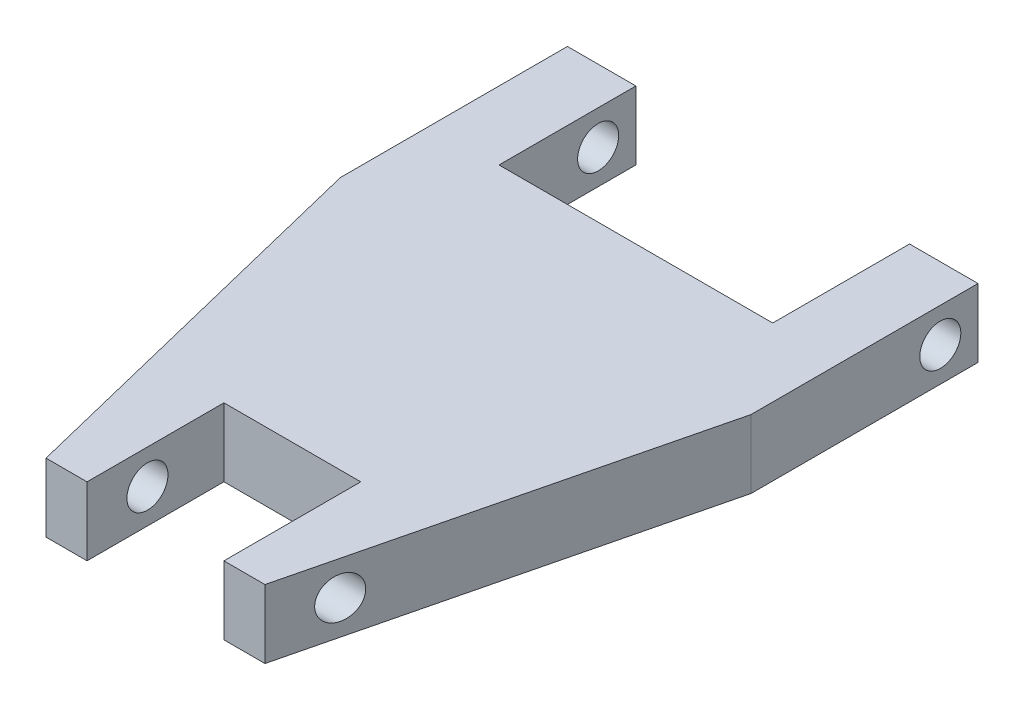
ISO-10303-21;
HEADER;
FILE_DESCRIPTION(('STEP AP214'),'2;1');
FILE_NAME('part.step','',(''),(''),'','','');
FILE_SCHEMA(('AUTOMOTIVE_DESIGN { 1 0 10303 214 1 1 1 1 }'));
ENDSEC;
DATA;
#1=APPLICATION_CONTEXT('core data for automotive mechanical design processes');
#2=APPLICATION_PROTOCOL_DEFINITION('international standard','automotive_design',2000,#1);
#3=PRODUCT_CONTEXT('',#1,'mechanical');
#4=PRODUCT('Part','Part','',(#3));
#5=PRODUCT_RELATED_PRODUCT_CATEGORY('part','',(#4));
#6=PRODUCT_DEFINITION_FORMATION('','',#4);
#7=PRODUCT_DEFINITION_CONTEXT('part definition',#1,'design');
#8=PRODUCT_DEFINITION('design','',#6,#7);
#9=PRODUCT_DEFINITION_SHAPE('','',#8);
#10=(LENGTH_UNIT() NAMED_UNIT(*) SI_UNIT(.MILLI.,.METRE.));
#11=(NAMED_UNIT(*) PLANE_ANGLE_UNIT() SI_UNIT($,.RADIAN.));
#12=(NAMED_UNIT(*) SI_UNIT($,.STERADIAN.) SOLID_ANGLE_UNIT());
#13=UNCERTAINTY_MEASURE_WITH_UNIT(LENGTH_MEASURE(1.E-05),#10,'distance_accuracy_value','');
#14=(GEOMETRIC_REPRESENTATION_CONTEXT(3) GLOBAL_UNCERTAINTY_ASSIGNED_CONTEXT((#13)) GLOBAL_UNIT_ASSIGNED_CONTEXT((#10,
#11,#12)) REPRESENTATION_CONTEXT('',''));
#15=CARTESIAN_POINT('',(0.,0.,0.));
#16=DIRECTION('',(0.,0.,1.));
#17=DIRECTION('',(1.,0.,0.));
#18=AXIS2_PLACEMENT_3D('',#15,#16,#17);
#19=CARTESIAN_POINT('',(0.,3.175,15.9557985351339));
#20=DIRECTION('',(0.,0.,-1.));
#21=DIRECTION('',(-1.,0.,0.));
#22=AXIS2_PLACEMENT_3D('',#19,#20,#21);
#23=PLANE('',#22);
#24=DIRECTION('',(1.,0.,0.));
#25=VECTOR('',#24,1.);
#26=CARTESIAN_POINT('',(0.,-3.175,15.9557985351339));
#27=LINE('',#26,#25);
#28=CARTESIAN_POINT('',(-6.35,-3.175,15.9557985351339));
#29=VERTEX_POINT('',#28);
#30=CARTESIAN_POINT('',(6.35000000000001,-3.175,15.9557985351339));
#31=VERTEX_POINT('',#30);
#32=EDGE_CURVE('E172',#29,#31,#27,.T.);
#33=ORIENTED_EDGE('',*,*,#32,.T.);
#34=DIRECTION('',(0.,-1.,0.));
#35=VECTOR('',#34,1.);
#36=CARTESIAN_POINT('',(6.35000000000001,3.175,15.9557985351339));
#37=LINE('',#36,#35);
#38=CARTESIAN_POINT('',(6.35000000000001,3.175,15.9557985351339));
#39=VERTEX_POINT('',#38);
#40=EDGE_CURVE('E11',#39,#31,#37,.T.);
#41=ORIENTED_EDGE('',*,*,#40,.F.);
#42=DIRECTION('',(1.,0.,0.));
#43=VECTOR('',#42,1.);
#44=CARTESIAN_POINT('',(0.,3.175,15.9557985351339));
#45=LINE('',#44,#43);
#46=CARTESIAN_POINT('',(-6.35,3.175,15.9557985351339));
#47=VERTEX_POINT('',#46);
#48=EDGE_CURVE('E115',#47,#39,#45,.T.);
#49=ORIENTED_EDGE('',*,*,#48,.F.);
#50=DIRECTION('',(0.,-1.,0.));
#51=VECTOR('',#50,1.);
#52=CARTESIAN_POINT('',(-6.35,3.175,15.9557985351339));
#53=LINE('',#52,#51);
#54=EDGE_CURVE('E168',#47,#29,#53,.T.);
#55=ORIENTED_EDGE('',*,*,#54,.T.);
#56=EDGE_LOOP('',(#33,#41,#49,#55));
#57=FACE_BOUND('',#56,.T.);
#58=ADVANCED_FACE('F40',(#57),#23,.F.);
#59=CARTESIAN_POINT('',(6.35,3.175,0.));
#60=DIRECTION('',(-1.,0.,0.));
#61=DIRECTION('',(0.,0.,1.));
#62=AXIS2_PLACEMENT_3D('',#59,#60,#61);
#63=PLANE('',#62);
#64=CARTESIAN_POINT('',(6.35000000000001,0.,23.0497661701747));
#65=DIRECTION('',(-1.,0.,0.));
#66=DIRECTION('',(0.,0.,1.));
#67=AXIS2_PLACEMENT_3D('',#64,#65,#66);
#68=CIRCLE('',#67,1.905);
#69=CARTESIAN_POINT('',(6.35000000000001,0.,24.9547661701747));
#70=VERTEX_POINT('',#69);
#71=EDGE_CURVE('E342',#70,#70,#68,.T.);
#72=ORIENTED_EDGE('',*,*,#71,.F.);
#73=EDGE_LOOP('',(#72));
#74=FACE_BOUND('',#73,.T.);
#75=DIRECTION('',(0.,0.,-1.));
#76=VECTOR('',#75,1.);
#77=CARTESIAN_POINT('',(6.35,-3.175,0.));
#78=LINE('',#77,#76);
#79=CARTESIAN_POINT('',(6.35000000000001,-3.175,28.6557985351339));
#80=VERTEX_POINT('',#79);
#81=EDGE_CURVE('E175',#80,#31,#78,.T.);
#82=ORIENTED_EDGE('',*,*,#81,.F.);
#83=DIRECTION('',(0.,-1.,0.));
#84=VECTOR('',#83,1.);
#85=CARTESIAN_POINT('',(6.35000000000001,3.175,28.6557985351339));
#86=LINE('',#85,#84);
#87=CARTESIAN_POINT('',(6.35000000000001,3.175,28.6557985351339));
#88=VERTEX_POINT('',#87);
#89=EDGE_CURVE('E49',#88,#80,#86,.T.);
#90=ORIENTED_EDGE('',*,*,#89,.F.);
#91=DIRECTION('',(0.,0.,-1.));
#92=VECTOR('',#91,1.);
#93=CARTESIAN_POINT('',(6.35,3.175,0.));
#94=LINE('',#93,#92);
#95=EDGE_CURVE('E249',#88,#39,#94,.T.);
#96=ORIENTED_EDGE('',*,*,#95,.T.);
#97=ORIENTED_EDGE('',*,*,#40,.T.);
#98=EDGE_LOOP('',(#82,#90,#96,#97));
#99=FACE_BOUND('',#98,.T.);
#100=ADVANCED_FACE('F236',(#74,#99),#63,.T.);
#101=CARTESIAN_POINT('',(0.,3.175,28.6557985351339));
#102=DIRECTION('',(0.,0.,1.));
#103=DIRECTION('',(1.,0.,0.));
#104=AXIS2_PLACEMENT_3D('',#101,#102,#103);
#105=PLANE('',#104);
#106=DIRECTION('',(-1.,0.,0.));
#107=VECTOR('',#106,1.);
#108=CARTESIAN_POINT('',(0.,-3.175,28.6557985351339));
#109=LINE('',#108,#107);
#110=CARTESIAN_POINT('',(10.16,-3.175,28.6557985351339));
#111=VERTEX_POINT('',#110);
#112=EDGE_CURVE('E179',#111,#80,#109,.T.);
#113=ORIENTED_EDGE('',*,*,#112,.F.);
#114=DIRECTION('',(0.,-1.,0.));
#115=VECTOR('',#114,1.);
#116=CARTESIAN_POINT('',(10.16,3.175,28.6557985351339));
#117=LINE('',#116,#115);
#118=CARTESIAN_POINT('',(10.16,3.175,28.6557985351339));
#119=VERTEX_POINT('',#118);
#120=EDGE_CURVE('E225',#119,#111,#117,.T.);
#121=ORIENTED_EDGE('',*,*,#120,.F.);
#122=DIRECTION('',(-1.,0.,0.));
#123=VECTOR('',#122,1.);
#124=CARTESIAN_POINT('',(0.,3.175,28.6557985351339));
#125=LINE('',#124,#123);
#126=EDGE_CURVE('E233',#119,#88,#125,.T.);
#127=ORIENTED_EDGE('',*,*,#126,.T.);
#128=ORIENTED_EDGE('',*,*,#89,.T.);
#129=EDGE_LOOP('',(#113,#121,#127,#128));
#130=FACE_BOUND('',#129,.T.);
#131=ADVANCED_FACE('F231',(#130),#105,.T.);
#132=CARTESIAN_POINT('',(16.2170350834316,3.175,3.98084427728299));
#133=DIRECTION('',(0.971168140796457,0.,0.238395558477824));
#134=DIRECTION('',(0.238395558477825,0.,-0.971168140796457));
#135=AXIS2_PLACEMENT_3D('',#132,#133,#134);
#136=PLANE('',#135);
#137=CARTESIAN_POINT('',(11.5361295911058,0.,23.0497661701747));
#138=DIRECTION('',(0.971168140796457,0.,0.238395558477824));
#139=DIRECTION('',(-0.238395558477825,0.,0.971168140796457));
#140=AXIS2_PLACEMENT_3D('',#137,#138,#139);
#141=ELLIPSE('',#140,1.96155528582075,1.905);
#142=CARTESIAN_POINT('',(11.0685035232574,0.,24.9547661701747));
#143=VERTEX_POINT('',#142);
#144=EDGE_CURVE('E339',#143,#143,#141,.T.);
#145=ORIENTED_EDGE('',*,*,#144,.F.);
#146=EDGE_LOOP('',(#145));
#147=FACE_BOUND('',#146,.T.);
#148=DIRECTION('',(-0.238395558477825,0.,0.971168140796457));
#149=VECTOR('',#148,1.);
#150=CARTESIAN_POINT('',(16.2170350834316,-3.175,3.98084427728299));
#151=LINE('',#150,#149);
#152=CARTESIAN_POINT('',(19.05,-3.175,-7.55999687148901));
#153=VERTEX_POINT('',#152);
#154=EDGE_CURVE('E182',#153,#111,#151,.T.);
#155=ORIENTED_EDGE('',*,*,#154,.F.);
#156=DIRECTION('',(0.,-1.,0.));
#157=VECTOR('',#156,1.);
#158=CARTESIAN_POINT('',(19.05,3.175,-7.55999687148901));
#159=LINE('',#158,#157);
#160=CARTESIAN_POINT('',(19.05,3.175,-7.55999687148901));
#161=VERTEX_POINT('',#160);
#162=EDGE_CURVE('E223',#161,#153,#159,.T.);
#163=ORIENTED_EDGE('',*,*,#162,.F.);
#164=DIRECTION('',(-0.238395558477825,0.,0.971168140796457));
#165=VECTOR('',#164,1.);
#166=CARTESIAN_POINT('',(16.2170350834316,3.175,3.98084427728299));
#167=LINE('',#166,#165);
#168=EDGE_CURVE('E246',#161,#119,#167,.T.);
#169=ORIENTED_EDGE('',*,*,#168,.T.);
#170=ORIENTED_EDGE('',*,*,#120,.T.);
#171=EDGE_LOOP('',(#155,#163,#169,#170));
#172=FACE_BOUND('',#171,.T.);
#173=ADVANCED_FACE('F243',(#147,#172),#136,.T.);
#174=CARTESIAN_POINT('',(19.05,3.175,0.));
#175=DIRECTION('',(1.,0.,0.));
#176=DIRECTION('',(0.,0.,-1.));
#177=AXIS2_PLACEMENT_3D('',#174,#175,#176);
#178=PLANE('',#177);
#179=CARTESIAN_POINT('',(19.05,0.,-25.1222037596364));
#180=DIRECTION('',(-1.,0.,0.));
#181=DIRECTION('',(0.,0.,1.));
#182=AXIS2_PLACEMENT_3D('',#179,#180,#181);
#183=CIRCLE('',#182,1.905);
#184=CARTESIAN_POINT('',(19.05,0.,-23.2172037596364));
#185=VERTEX_POINT('',#184);
#186=EDGE_CURVE('E344',#185,#185,#183,.T.);
#187=ORIENTED_EDGE('',*,*,#186,.T.);
#188=EDGE_LOOP('',(#187));
#189=FACE_BOUND('',#188,.T.);
#190=DIRECTION('',(0.,0.,1.));
#191=VECTOR('',#190,1.);
#192=CARTESIAN_POINT('',(19.05,-3.175,0.));
#193=LINE('',#192,#191);
#194=CARTESIAN_POINT('',(19.05,-3.175,-28.6230022864999));
#195=VERTEX_POINT('',#194);
#196=EDGE_CURVE('E185',#195,#153,#193,.T.);
#197=ORIENTED_EDGE('',*,*,#196,.F.);
#198=DIRECTION('',(0.,-1.,0.));
#199=VECTOR('',#198,1.);
#200=CARTESIAN_POINT('',(19.05,3.175,-28.6230022864999));
#201=LINE('',#200,#199);
#202=CARTESIAN_POINT('',(19.05,3.175,-28.6230022864999));
#203=VERTEX_POINT('',#202);
#204=EDGE_CURVE('E221',#203,#195,#201,.T.);
#205=ORIENTED_EDGE('',*,*,#204,.F.);
#206=DIRECTION('',(0.,0.,1.));
#207=VECTOR('',#206,1.);
#208=CARTESIAN_POINT('',(19.05,3.175,0.));
#209=LINE('',#208,#207);
#210=EDGE_CURVE('E251',#203,#161,#209,.T.);
#211=ORIENTED_EDGE('',*,*,#210,.T.);
#212=ORIENTED_EDGE('',*,*,#162,.T.);
#213=EDGE_LOOP('',(#197,#205,#211,#212));
#214=FACE_BOUND('',#213,.T.);
#215=ADVANCED_FACE('F305',(#189,#214),#178,.T.);
#216=CARTESIAN_POINT('',(0.,3.175,-28.6230022864999));
#217=DIRECTION('',(0.,0.,-1.));
#218=DIRECTION('',(-1.,0.,0.));
#219=AXIS2_PLACEMENT_3D('',#216,#217,#218);
#220=PLANE('',#219);
#221=DIRECTION('',(1.,0.,0.));
#222=VECTOR('',#221,1.);
#223=CARTESIAN_POINT('',(0.,-3.175,-28.6230022864999));
#224=LINE('',#223,#222);
#225=CARTESIAN_POINT('',(12.7,-3.175,-28.6230022864999));
#226=VERTEX_POINT('',#225);
#227=EDGE_CURVE('E188',#226,#195,#224,.T.);
#228=ORIENTED_EDGE('',*,*,#227,.F.);
#229=DIRECTION('',(0.,-1.,0.));
#230=VECTOR('',#229,1.);
#231=CARTESIAN_POINT('',(12.7,3.175,-28.6230022864999));
#232=LINE('',#231,#230);
#233=CARTESIAN_POINT('',(12.7,3.175,-28.6230022864999));
#234=VERTEX_POINT('',#233);
#235=EDGE_CURVE('E219',#234,#226,#232,.T.);
#236=ORIENTED_EDGE('',*,*,#235,.F.);
#237=DIRECTION('',(1.,0.,0.));
#238=VECTOR('',#237,1.);
#239=CARTESIAN_POINT('',(0.,3.175,-28.6230022864999));
#240=LINE('',#239,#238);
#241=EDGE_CURVE('E257',#234,#203,#240,.T.);
#242=ORIENTED_EDGE('',*,*,#241,.T.);
#243=ORIENTED_EDGE('',*,*,#204,.T.);
#244=EDGE_LOOP('',(#228,#236,#242,#243));
#245=FACE_BOUND('',#244,.T.);
#246=ADVANCED_FACE('F309',(#245),#220,.T.);
#247=CARTESIAN_POINT('',(12.7,3.175,0.));
#248=DIRECTION('',(1.,0.,0.));
#249=DIRECTION('',(0.,0.,-1.));
#250=AXIS2_PLACEMENT_3D('',#247,#248,#249);
#251=PLANE('',#250);
#252=CARTESIAN_POINT('',(12.7,0.,-25.1222037596364));
#253=DIRECTION('',(1.,0.,0.));
#254=DIRECTION('',(0.,0.,-1.));
#255=AXIS2_PLACEMENT_3D('',#252,#253,#254);
#256=CIRCLE('',#255,1.905);
#257=CARTESIAN_POINT('',(12.7,0.,-27.0272037596364));
#258=VERTEX_POINT('',#257);
#259=EDGE_CURVE('E176',#258,#258,#256,.T.);
#260=ORIENTED_EDGE('',*,*,#259,.T.);
#261=EDGE_LOOP('',(#260));
#262=FACE_BOUND('',#261,.T.);
#263=DIRECTION('',(0.,0.,1.));
#264=VECTOR('',#263,1.);
#265=CARTESIAN_POINT('',(12.7,-3.175,0.));
#266=LINE('',#265,#264);
#267=CARTESIAN_POINT('',(12.7,-3.175,-15.9230022864999));
#268=VERTEX_POINT('',#267);
#269=EDGE_CURVE('E191',#226,#268,#266,.T.);
#270=ORIENTED_EDGE('',*,*,#269,.T.);
#271=DIRECTION('',(0.,-1.,0.));
#272=VECTOR('',#271,1.);
#273=CARTESIAN_POINT('',(12.7,3.175,-15.9230022864999));
#274=LINE('',#273,#272);
#275=CARTESIAN_POINT('',(12.7,3.175,-15.9230022864999));
#276=VERTEX_POINT('',#275);
#277=EDGE_CURVE('E217',#276,#268,#274,.T.);
#278=ORIENTED_EDGE('',*,*,#277,.F.);
#279=DIRECTION('',(0.,0.,1.));
#280=VECTOR('',#279,1.);
#281=CARTESIAN_POINT('',(12.7,3.175,0.));
#282=LINE('',#281,#280);
#283=EDGE_CURVE('E260',#234,#276,#282,.T.);
#284=ORIENTED_EDGE('',*,*,#283,.F.);
#285=ORIENTED_EDGE('',*,*,#235,.T.);
#286=EDGE_LOOP('',(#270,#278,#284,#285));
#287=FACE_BOUND('',#286,.T.);
#288=ADVANCED_FACE('F313',(#262,#287),#251,.F.);
#289=CARTESIAN_POINT('',(0.,3.175,-15.9230022864999));
#290=DIRECTION('',(0.,0.,-1.));
#291=DIRECTION('',(-1.,0.,0.));
#292=AXIS2_PLACEMENT_3D('',#289,#290,#291);
#293=PLANE('',#292);
#294=DIRECTION('',(1.,0.,0.));
#295=VECTOR('',#294,1.);
#296=CARTESIAN_POINT('',(0.,-3.175,-15.9230022864999));
#297=LINE('',#296,#295);
#298=CARTESIAN_POINT('',(-12.7,-3.175,-15.9230022864999));
#299=VERTEX_POINT('',#298);
#300=EDGE_CURVE('E194',#299,#268,#297,.T.);
#301=ORIENTED_EDGE('',*,*,#300,.F.);
#302=DIRECTION('',(0.,-1.,0.));
#303=VECTOR('',#302,1.);
#304=CARTESIAN_POINT('',(-12.7,3.175,-15.9230022864999));
#305=LINE('',#304,#303);
#306=CARTESIAN_POINT('',(-12.7,3.175,-15.9230022864999));
#307=VERTEX_POINT('',#306);
#308=EDGE_CURVE('E215',#307,#299,#305,.T.);
#309=ORIENTED_EDGE('',*,*,#308,.F.);
#310=DIRECTION('',(1.,0.,0.));
#311=VECTOR('',#310,1.);
#312=CARTESIAN_POINT('',(0.,3.175,-15.9230022864999));
#313=LINE('',#312,#311);
#314=EDGE_CURVE('E262',#307,#276,#313,.T.);
#315=ORIENTED_EDGE('',*,*,#314,.T.);
#316=ORIENTED_EDGE('',*,*,#277,.T.);
#317=EDGE_LOOP('',(#301,#309,#315,#316));
#318=FACE_BOUND('',#317,.T.);
#319=ADVANCED_FACE('F317',(#318),#293,.T.);
#320=CARTESIAN_POINT('',(-12.7,3.175,0.));
#321=DIRECTION('',(1.,0.,0.));
#322=DIRECTION('',(0.,0.,-1.));
#323=AXIS2_PLACEMENT_3D('',#320,#321,#322);
#324=PLANE('',#323);
#325=CARTESIAN_POINT('',(-12.7,0.,-25.1222037596364));
#326=DIRECTION('',(1.,0.,0.));
#327=DIRECTION('',(0.,0.,-1.));
#328=AXIS2_PLACEMENT_3D('',#325,#326,#327);
#329=CIRCLE('',#328,1.905);
#330=CARTESIAN_POINT('',(-12.7,0.,-27.0272037596364));
#331=VERTEX_POINT('',#330);
#332=EDGE_CURVE('E350',#331,#331,#329,.T.);
#333=ORIENTED_EDGE('',*,*,#332,.F.);
#334=EDGE_LOOP('',(#333));
#335=FACE_BOUND('',#334,.T.);
#336=DIRECTION('',(0.,0.,1.));
#337=VECTOR('',#336,1.);
#338=CARTESIAN_POINT('',(-12.7,-3.175,0.));
#339=LINE('',#338,#337);
#340=CARTESIAN_POINT('',(-12.7,-3.175,-28.6230022864999));
#341=VERTEX_POINT('',#340);
#342=EDGE_CURVE('E197',#341,#299,#339,.T.);
#343=ORIENTED_EDGE('',*,*,#342,.F.);
#344=DIRECTION('',(0.,-1.,0.));
#345=VECTOR('',#344,1.);
#346=CARTESIAN_POINT('',(-12.7,3.175,-28.6230022864999));
#347=LINE('',#346,#345);
#348=CARTESIAN_POINT('',(-12.7,3.175,-28.6230022864999));
#349=VERTEX_POINT('',#348);
#350=EDGE_CURVE('E213',#349,#341,#347,.T.);
#351=ORIENTED_EDGE('',*,*,#350,.F.);
#352=DIRECTION('',(0.,0.,1.));
#353=VECTOR('',#352,1.);
#354=CARTESIAN_POINT('',(-12.7,3.175,0.));
#355=LINE('',#354,#353);
#356=EDGE_CURVE('E265',#349,#307,#355,.T.);
#357=ORIENTED_EDGE('',*,*,#356,.T.);
#358=ORIENTED_EDGE('',*,*,#308,.T.);
#359=EDGE_LOOP('',(#343,#351,#357,#358));
#360=FACE_BOUND('',#359,.T.);
#361=ADVANCED_FACE('F321',(#335,#360),#324,.T.);
#362=CARTESIAN_POINT('',(0.,3.175,-28.6230022864999));
#363=DIRECTION('',(0.,0.,1.));
#364=DIRECTION('',(1.,0.,0.));
#365=AXIS2_PLACEMENT_3D('',#362,#363,#364);
#366=PLANE('',#365);
#367=DIRECTION('',(-1.,0.,0.));
#368=VECTOR('',#367,1.);
#369=CARTESIAN_POINT('',(0.,-3.175,-28.6230022864999));
#370=LINE('',#369,#368);
#371=CARTESIAN_POINT('',(-19.05,-3.175,-28.6230022864999));
#372=VERTEX_POINT('',#371);
#373=EDGE_CURVE('E200',#341,#372,#370,.T.);
#374=ORIENTED_EDGE('',*,*,#373,.T.);
#375=DIRECTION('',(0.,-1.,0.));
#376=VECTOR('',#375,1.);
#377=CARTESIAN_POINT('',(-19.05,3.175,-28.6230022864999));
#378=LINE('',#377,#376);
#379=CARTESIAN_POINT('',(-19.05,3.175,-28.6230022864999));
#380=VERTEX_POINT('',#379);
#381=EDGE_CURVE('E210',#380,#372,#378,.T.);
#382=ORIENTED_EDGE('',*,*,#381,.F.);
#383=DIRECTION('',(-1.,0.,0.));
#384=VECTOR('',#383,1.);
#385=CARTESIAN_POINT('',(0.,3.175,-28.6230022864999));
#386=LINE('',#385,#384);
#387=EDGE_CURVE('E268',#349,#380,#386,.T.);
#388=ORIENTED_EDGE('',*,*,#387,.F.);
#389=ORIENTED_EDGE('',*,*,#350,.T.);
#390=EDGE_LOOP('',(#374,#382,#388,#389));
#391=FACE_BOUND('',#390,.T.);
#392=ADVANCED_FACE('F274',(#391),#366,.F.);
#393=CARTESIAN_POINT('',(-19.05,3.175,0.));
#394=DIRECTION('',(1.,0.,0.));
#395=DIRECTION('',(0.,0.,-1.));
#396=AXIS2_PLACEMENT_3D('',#393,#394,#395);
#397=PLANE('',#396);
#398=CARTESIAN_POINT('',(-19.05,0.,-25.1222037596364));
#399=DIRECTION('',(-1.,0.,0.));
#400=DIRECTION('',(0.,0.,1.));
#401=AXIS2_PLACEMENT_3D('',#398,#399,#400);
#402=CIRCLE('',#401,1.905);
#403=CARTESIAN_POINT('',(-19.05,0.,-23.2172037596364));
#404=VERTEX_POINT('',#403);
#405=EDGE_CURVE('E493',#404,#404,#402,.T.);
#406=ORIENTED_EDGE('',*,*,#405,.F.);
#407=EDGE_LOOP('',(#406));
#408=FACE_BOUND('',#407,.T.);
#409=DIRECTION('',(0.,0.,1.));
#410=VECTOR('',#409,1.);
#411=CARTESIAN_POINT('',(-19.05,-3.175,0.));
#412=LINE('',#411,#410);
#413=CARTESIAN_POINT('',(-19.05,-3.175,-7.55999687148901));
#414=VERTEX_POINT('',#413);
#415=EDGE_CURVE('E202',#372,#414,#412,.T.);
#416=ORIENTED_EDGE('',*,*,#415,.T.);
#417=DIRECTION('',(0.,-1.,0.));
#418=VECTOR('',#417,1.);
#419=CARTESIAN_POINT('',(-19.05,3.175,-7.55999687148901));
#420=LINE('',#419,#418);
#421=CARTESIAN_POINT('',(-19.05,3.175,-7.55999687148901));
#422=VERTEX_POINT('',#421);
#423=EDGE_CURVE('E163',#422,#414,#420,.T.);
#424=ORIENTED_EDGE('',*,*,#423,.F.);
#425=DIRECTION('',(0.,0.,1.));
#426=VECTOR('',#425,1.);
#427=CARTESIAN_POINT('',(-19.05,3.175,0.));
#428=LINE('',#427,#426);
#429=EDGE_CURVE('E154',#380,#422,#428,.T.);
#430=ORIENTED_EDGE('',*,*,#429,.F.);
#431=ORIENTED_EDGE('',*,*,#381,.T.);
#432=EDGE_LOOP('',(#416,#424,#430,#431));
#433=FACE_BOUND('',#432,.T.);
#434=ADVANCED_FACE('F278',(#408,#433),#397,.F.);
#435=CARTESIAN_POINT('',(-16.2170350834315,3.175,3.980844277283));
#436=DIRECTION('',(0.971168140796457,0.,-0.238395558477825));
#437=DIRECTION('',(-0.238395558477825,0.,-0.971168140796457));
#438=AXIS2_PLACEMENT_3D('',#435,#436,#437);
#439=PLANE('',#438);
#440=CARTESIAN_POINT('',(-11.5361295911058,0.,23.0497661701747));
#441=DIRECTION('',(0.971168140796457,0.,-0.238395558477825));
#442=DIRECTION('',(-0.238395558477825,0.,-0.971168140796457));
#443=AXIS2_PLACEMENT_3D('',#440,#441,#442);
#444=ELLIPSE('',#443,1.96155528582075,1.905);
#445=CARTESIAN_POINT('',(-12.0037556589541,0.,21.1447661701747));
#446=VERTEX_POINT('',#445);
#447=EDGE_CURVE('E337',#446,#446,#444,.T.);
#448=ORIENTED_EDGE('',*,*,#447,.T.);
#449=EDGE_LOOP('',(#448));
#450=FACE_BOUND('',#449,.T.);
#451=DIRECTION('',(0.238395558477825,0.,0.971168140796457));
#452=VECTOR('',#451,1.);
#453=CARTESIAN_POINT('',(-16.2170350834315,-3.175,3.980844277283));
#454=LINE('',#453,#452);
#455=CARTESIAN_POINT('',(-10.16,-3.175,28.6557985351339));
#456=VERTEX_POINT('',#455);
#457=EDGE_CURVE('E162',#414,#456,#454,.T.);
#458=ORIENTED_EDGE('',*,*,#457,.T.);
#459=DIRECTION('',(0.,-1.,0.));
#460=VECTOR('',#459,1.);
#461=CARTESIAN_POINT('',(-10.16,3.175,28.6557985351339));
#462=LINE('',#461,#460);
#463=CARTESIAN_POINT('',(-10.16,3.175,28.6557985351339));
#464=VERTEX_POINT('',#463);
#465=EDGE_CURVE('E159',#464,#456,#462,.T.);
#466=ORIENTED_EDGE('',*,*,#465,.F.);
#467=DIRECTION('',(0.238395558477825,0.,0.971168140796457));
#468=VECTOR('',#467,1.);
#469=CARTESIAN_POINT('',(-16.2170350834315,3.175,3.980844277283));
#470=LINE('',#469,#468);
#471=EDGE_CURVE('E148',#422,#464,#470,.T.);
#472=ORIENTED_EDGE('',*,*,#471,.F.);
#473=ORIENTED_EDGE('',*,*,#423,.T.);
#474=EDGE_LOOP('',(#458,#466,#472,#473));
#475=FACE_BOUND('',#474,.T.);
#476=ADVANCED_FACE('F160',(#450,#475),#439,.F.);
#477=CARTESIAN_POINT('',(0.,3.175,28.6557985351339));
#478=DIRECTION('',(0.,0.,-1.));
#479=DIRECTION('',(-1.,0.,0.));
#480=AXIS2_PLACEMENT_3D('',#477,#478,#479);
#481=PLANE('',#480);
#482=DIRECTION('',(1.,0.,0.));
#483=VECTOR('',#482,1.);
#484=CARTESIAN_POINT('',(0.,-3.175,28.6557985351339));
#485=LINE('',#484,#483);
#486=CARTESIAN_POINT('',(-6.35,-3.175,28.6557985351339));
#487=VERTEX_POINT('',#486);
#488=EDGE_CURVE('E103',#456,#487,#485,.T.);
#489=ORIENTED_EDGE('',*,*,#488,.T.);
#490=DIRECTION('',(0.,-1.,0.));
#491=VECTOR('',#490,1.);
#492=CARTESIAN_POINT('',(-6.35,3.175,28.6557985351339));
#493=LINE('',#492,#491);
#494=CARTESIAN_POINT('',(-6.35,3.175,28.6557985351339));
#495=VERTEX_POINT('',#494);
#496=EDGE_CURVE('E164',#495,#487,#493,.T.);
#497=ORIENTED_EDGE('',*,*,#496,.F.);
#498=DIRECTION('',(1.,0.,0.));
#499=VECTOR('',#498,1.);
#500=CARTESIAN_POINT('',(0.,3.175,28.6557985351339));
#501=LINE('',#500,#499);
#502=EDGE_CURVE('E152',#464,#495,#501,.T.);
#503=ORIENTED_EDGE('',*,*,#502,.F.);
#504=ORIENTED_EDGE('',*,*,#465,.T.);
#505=EDGE_LOOP('',(#489,#497,#503,#504));
#506=FACE_BOUND('',#505,.T.);
#507=ADVANCED_FACE('F166',(#506),#481,.F.);
#508=CARTESIAN_POINT('',(-6.35,3.175,0.));
#509=DIRECTION('',(-1.,0.,0.));
#510=DIRECTION('',(0.,0.,1.));
#511=AXIS2_PLACEMENT_3D('',#508,#509,#510);
#512=PLANE('',#511);
#513=CARTESIAN_POINT('',(-6.34999999999999,0.,23.0497661701747));
#514=DIRECTION('',(-1.,0.,0.));
#515=DIRECTION('',(0.,0.,1.));
#516=AXIS2_PLACEMENT_3D('',#513,#514,#515);
#517=CIRCLE('',#516,1.905);
#518=CARTESIAN_POINT('',(-6.34999999999999,0.,24.9547661701747));
#519=VERTEX_POINT('',#518);
#520=EDGE_CURVE('E43',#519,#519,#517,.T.);
#521=ORIENTED_EDGE('',*,*,#520,.T.);
#522=EDGE_LOOP('',(#521));
#523=FACE_BOUND('',#522,.T.);
#524=DIRECTION('',(0.,0.,-1.));
#525=VECTOR('',#524,1.);
#526=CARTESIAN_POINT('',(-6.35,-3.175,0.));
#527=LINE('',#526,#525);
#528=EDGE_CURVE('E109',#487,#29,#527,.T.);
#529=ORIENTED_EDGE('',*,*,#528,.T.);
#530=ORIENTED_EDGE('',*,*,#54,.F.);
#531=DIRECTION('',(0.,0.,-1.));
#532=VECTOR('',#531,1.);
#533=CARTESIAN_POINT('',(-6.35,3.175,0.));
#534=LINE('',#533,#532);
#535=EDGE_CURVE('E57',#495,#47,#534,.T.);
#536=ORIENTED_EDGE('',*,*,#535,.F.);
#537=ORIENTED_EDGE('',*,*,#496,.T.);
#538=EDGE_LOOP('',(#529,#530,#536,#537));
#539=FACE_BOUND('',#538,.T.);
#540=ADVANCED_FACE('F280',(#523,#539),#512,.F.);
#541=CARTESIAN_POINT('',(0.,3.175,0.));
#542=DIRECTION('',(0.,1.,0.));
#543=DIRECTION('',(0.,0.,1.));
#544=AXIS2_PLACEMENT_3D('',#541,#542,#543);
#545=PLANE('',#544);
#546=ORIENTED_EDGE('',*,*,#48,.T.);
#547=ORIENTED_EDGE('',*,*,#95,.F.);
#548=ORIENTED_EDGE('',*,*,#126,.F.);
#549=ORIENTED_EDGE('',*,*,#168,.F.);
#550=ORIENTED_EDGE('',*,*,#210,.F.);
#551=ORIENTED_EDGE('',*,*,#241,.F.);
#552=ORIENTED_EDGE('',*,*,#283,.T.);
#553=ORIENTED_EDGE('',*,*,#314,.F.);
#554=ORIENTED_EDGE('',*,*,#356,.F.);
#555=ORIENTED_EDGE('',*,*,#387,.T.);
#556=ORIENTED_EDGE('',*,*,#429,.T.);
#557=ORIENTED_EDGE('',*,*,#471,.T.);
#558=ORIENTED_EDGE('',*,*,#502,.T.);
#559=ORIENTED_EDGE('',*,*,#535,.T.);
#560=EDGE_LOOP('',(#546,#547,#548,#549,#550,#551,#552,#553,#554,#555,#556,#557,#558,#559));
#561=FACE_BOUND('',#560,.T.);
#562=ADVANCED_FACE('F150',(#561),#545,.T.);
#563=CARTESIAN_POINT('',(0.,-3.175,0.));
#564=DIRECTION('',(0.,1.,0.));
#565=DIRECTION('',(0.,0.,1.));
#566=AXIS2_PLACEMENT_3D('',#563,#564,#565);
#567=PLANE('',#566);
#568=ORIENTED_EDGE('',*,*,#32,.F.);
#569=ORIENTED_EDGE('',*,*,#528,.F.);
#570=ORIENTED_EDGE('',*,*,#488,.F.);
#571=ORIENTED_EDGE('',*,*,#457,.F.);
#572=ORIENTED_EDGE('',*,*,#415,.F.);
#573=ORIENTED_EDGE('',*,*,#373,.F.);
#574=ORIENTED_EDGE('',*,*,#342,.T.);
#575=ORIENTED_EDGE('',*,*,#300,.T.);
#576=ORIENTED_EDGE('',*,*,#269,.F.);
#577=ORIENTED_EDGE('',*,*,#227,.T.);
#578=ORIENTED_EDGE('',*,*,#196,.T.);
#579=ORIENTED_EDGE('',*,*,#154,.T.);
#580=ORIENTED_EDGE('',*,*,#112,.T.);
#581=ORIENTED_EDGE('',*,*,#81,.T.);
#582=EDGE_LOOP('',(#568,#569,#570,#571,#572,#573,#574,#575,#576,#577,#578,#579,#580,#581));
#583=FACE_BOUND('',#582,.T.);
#584=ADVANCED_FACE('F239',(#583),#567,.F.);
#585=CARTESIAN_POINT('',(19.05,0.,23.0497661701747));
#586=DIRECTION('',(-1.,0.,0.));
#587=DIRECTION('',(0.,0.,1.));
#588=AXIS2_PLACEMENT_3D('',#585,#586,#587);
#589=CYLINDRICAL_SURFACE('',#588,1.905);
#590=ORIENTED_EDGE('',*,*,#520,.F.);
#591=EDGE_LOOP('',(#590));
#592=FACE_BOUND('',#591,.T.);
#593=ORIENTED_EDGE('',*,*,#447,.F.);
#594=EDGE_LOOP('',(#593));
#595=FACE_BOUND('',#594,.T.);
#596=ADVANCED_FACE('F369',(#592,#595),#589,.F.);
#597=CARTESIAN_POINT('',(19.05,0.,-25.1222037596364));
#598=DIRECTION('',(-1.,0.,0.));
#599=DIRECTION('',(0.,0.,1.));
#600=AXIS2_PLACEMENT_3D('',#597,#598,#599);
#601=CYLINDRICAL_SURFACE('',#600,1.905);
#602=ORIENTED_EDGE('',*,*,#332,.T.);
#603=EDGE_LOOP('',(#602));
#604=FACE_BOUND('',#603,.T.);
#605=ORIENTED_EDGE('',*,*,#405,.T.);
#606=EDGE_LOOP('',(#605));
#607=FACE_BOUND('',#606,.T.);
#608=ADVANCED_FACE('F360',(#604,#607),#601,.F.);
#609=ORIENTED_EDGE('',*,*,#186,.F.);
#610=EDGE_LOOP('',(#609));
#611=FACE_BOUND('',#610,.T.);
#612=ORIENTED_EDGE('',*,*,#259,.F.);
#613=EDGE_LOOP('',(#612));
#614=FACE_BOUND('',#613,.T.);
#615=ADVANCED_FACE('F357',(#611,#614),#601,.F.);
#616=ORIENTED_EDGE('',*,*,#71,.T.);
#617=EDGE_LOOP('',(#616));
#618=FACE_BOUND('',#617,.T.);
#619=ORIENTED_EDGE('',*,*,#144,.T.);
#620=EDGE_LOOP('',(#619));
#621=FACE_BOUND('',#620,.T.);
#622=ADVANCED_FACE('F359',(#618,#621),#589,.F.);
#623=CLOSED_SHELL('',(#58,#100,#131,#173,#215,#246,#288,#319,#361,#392,#434,#476,#507,#540,#562,
#584,#596,#608,#615,#622));
#624=MANIFOLD_SOLID_BREP('B2',#623);
#625=ADVANCED_BREP_SHAPE_REPRESENTATION('',(#18,#624),#14);
#626=SHAPE_DEFINITION_REPRESENTATION(#9,#625);
ENDSEC;
END-ISO-10303-21;
